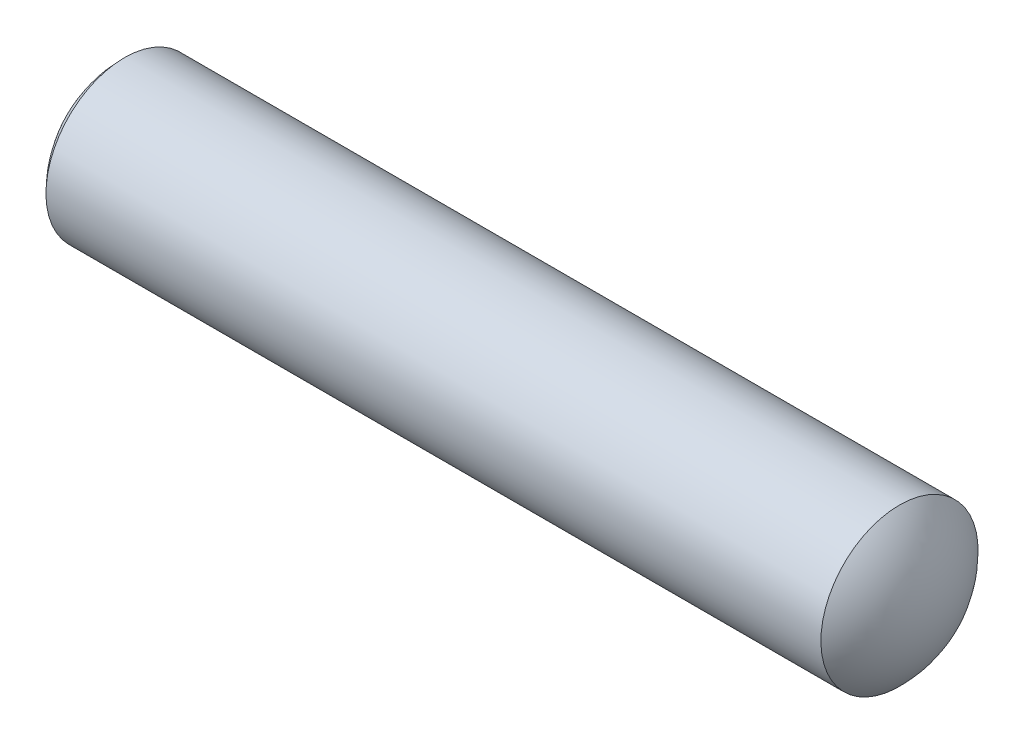
ISO-10303-21;
HEADER;
FILE_DESCRIPTION(('STEP AP214'),'2;1');
FILE_NAME('part.step','',(''),(''),'','','');
FILE_SCHEMA(('AUTOMOTIVE_DESIGN { 1 0 10303 214 1 1 1 1 }'));
ENDSEC;
DATA;
#1=APPLICATION_CONTEXT('core data for automotive mechanical design processes');
#2=APPLICATION_PROTOCOL_DEFINITION('international standard','automotive_design',2000,#1);
#3=PRODUCT_CONTEXT('',#1,'mechanical');
#4=PRODUCT('Part','Part','',(#3));
#5=PRODUCT_RELATED_PRODUCT_CATEGORY('part','',(#4));
#6=PRODUCT_DEFINITION_FORMATION('','',#4);
#7=PRODUCT_DEFINITION_CONTEXT('part definition',#1,'design');
#8=PRODUCT_DEFINITION('design','',#6,#7);
#9=PRODUCT_DEFINITION_SHAPE('','',#8);
#10=(LENGTH_UNIT() NAMED_UNIT(*) SI_UNIT(.MILLI.,.METRE.));
#11=(NAMED_UNIT(*) PLANE_ANGLE_UNIT() SI_UNIT($,.RADIAN.));
#12=(NAMED_UNIT(*) SI_UNIT($,.STERADIAN.) SOLID_ANGLE_UNIT());
#13=UNCERTAINTY_MEASURE_WITH_UNIT(LENGTH_MEASURE(1.E-05),#10,'distance_accuracy_value','');
#14=(GEOMETRIC_REPRESENTATION_CONTEXT(3) GLOBAL_UNCERTAINTY_ASSIGNED_CONTEXT((#13)) GLOBAL_UNIT_ASSIGNED_CONTEXT((#10,
#11,#12)) REPRESENTATION_CONTEXT('',''));
#15=CARTESIAN_POINT('',(0.,0.,0.));
#16=DIRECTION('',(0.,0.,1.));
#17=DIRECTION('',(1.,0.,0.));
#18=AXIS2_PLACEMENT_3D('',#15,#16,#17);
#19=CARTESIAN_POINT('',(15.1875,-21.3125,0.));
#20=DIRECTION('',(0.,0.,-1.));
#21=DIRECTION('',(1.,0.,0.));
#22=AXIS2_PLACEMENT_3D('',#19,#20,#21);
#23=SPHERICAL_SURFACE('',#22,1.8375);
#24=CARTESIAN_POINT('',(15.1875,-21.3125,0.));
#25=DIRECTION('',(-1.,0.,0.));
#26=DIRECTION('',(0.,1.,0.));
#27=AXIS2_PLACEMENT_3D('',#24,#25,#26);
#28=SPHERICAL_SURFACE('',#27,1.8375);
#29=CARTESIAN_POINT('',(16.4734821149612,-21.3125,0.));
#30=DIRECTION('',(-1.,0.,0.));
#31=DIRECTION('',(0.,1.,0.));
#32=AXIS2_PLACEMENT_3D('',#29,#30,#31);
#33=CIRCLE('',#32,1.3125);
#34=CARTESIAN_POINT('',(16.4734821149612,-20.,0.));
#35=VERTEX_POINT('',#34);
#36=EDGE_CURVE('E11',#35,#35,#33,.T.);
#37=ORIENTED_EDGE('',*,*,#36,.F.);
#38=EDGE_LOOP('',(#37));
#39=FACE_BOUND('',#38,.T.);
#40=ADVANCED_FACE('F17',(#39),#28,.T.);
#41=CARTESIAN_POINT('',(10.,-21.3125,0.));
#42=DIRECTION('',(-1.,0.,0.));
#43=DIRECTION('',(0.,1.,0.));
#44=AXIS2_PLACEMENT_3D('',#41,#42,#43);
#45=CYLINDRICAL_SURFACE('',#44,1.3125);
#46=CARTESIAN_POINT('',(3.52651788503884,-21.3125,0.));
#47=DIRECTION('',(-1.,0.,0.));
#48=DIRECTION('',(0.,1.,0.));
#49=AXIS2_PLACEMENT_3D('',#46,#47,#48);
#50=CIRCLE('',#49,1.3125);
#51=CARTESIAN_POINT('',(3.52651788503884,-20.,0.));
#52=VERTEX_POINT('',#51);
#53=EDGE_CURVE('E26',#52,#52,#50,.T.);
#54=ORIENTED_EDGE('',*,*,#53,.F.);
#55=EDGE_LOOP('',(#54));
#56=FACE_BOUND('',#55,.T.);
#57=ORIENTED_EDGE('',*,*,#36,.T.);
#58=EDGE_LOOP('',(#57));
#59=FACE_BOUND('',#58,.T.);
#60=ADVANCED_FACE('F19',(#56,#59),#45,.T.);
#61=CARTESIAN_POINT('',(4.8125,-21.3125,0.));
#62=DIRECTION('',(0.,0.,-1.));
#63=DIRECTION('',(-1.,0.,0.));
#64=AXIS2_PLACEMENT_3D('',#61,#62,#63);
#65=SPHERICAL_SURFACE('',#64,1.8375);
#66=CARTESIAN_POINT('',(4.8125,-21.3125,0.));
#67=DIRECTION('',(-1.,0.,0.));
#68=DIRECTION('',(0.,1.,0.));
#69=AXIS2_PLACEMENT_3D('',#66,#67,#68);
#70=SPHERICAL_SURFACE('',#69,1.8375);
#71=ORIENTED_EDGE('',*,*,#53,.T.);
#72=EDGE_LOOP('',(#71));
#73=FACE_BOUND('',#72,.T.);
#74=ADVANCED_FACE('F40',(#73),#70,.T.);
#75=CLOSED_SHELL('',(#40,#60,#74));
#76=MANIFOLD_SOLID_BREP('B1',#75);
#77=ADVANCED_BREP_SHAPE_REPRESENTATION('',(#18,#76),#14);
#78=SHAPE_DEFINITION_REPRESENTATION(#9,#77);
ENDSEC;
END-ISO-10303-21;
